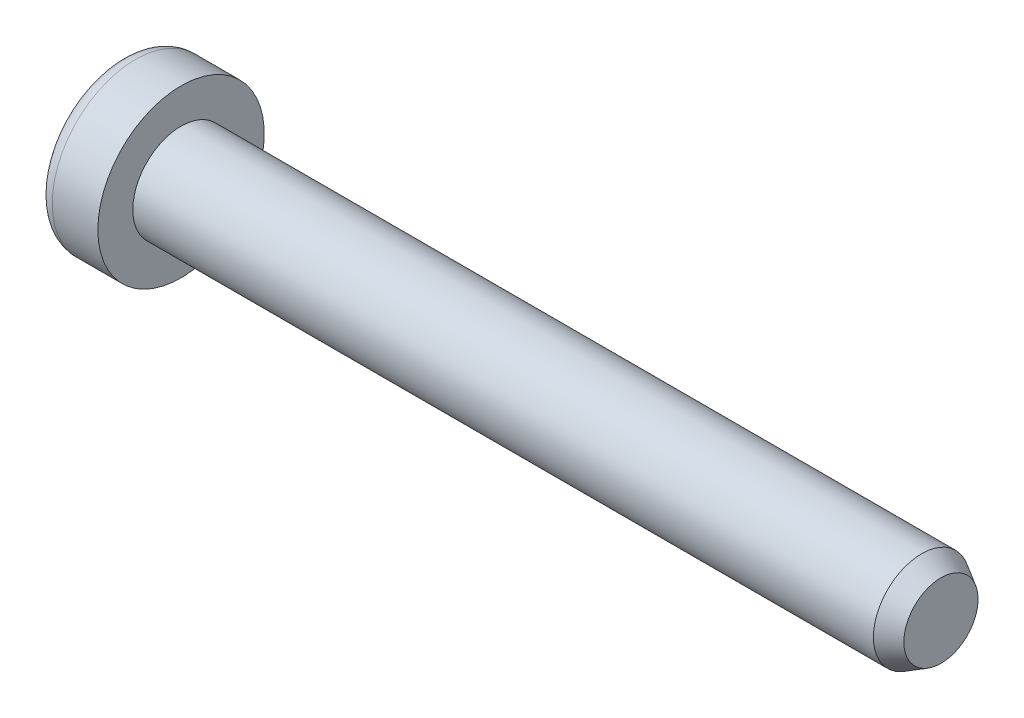
ISO-10303-21;
HEADER;
FILE_DESCRIPTION(('STEP AP214'),'2;1');
FILE_NAME('part.step','',(''),(''),'','','');
FILE_SCHEMA(('AUTOMOTIVE_DESIGN { 1 0 10303 214 1 1 1 1 }'));
ENDSEC;
DATA;
#1=APPLICATION_CONTEXT('core data for automotive mechanical design processes');
#2=APPLICATION_PROTOCOL_DEFINITION('international standard','automotive_design',2000,#1);
#3=PRODUCT_CONTEXT('',#1,'mechanical');
#4=PRODUCT('Part','Part','',(#3));
#5=PRODUCT_RELATED_PRODUCT_CATEGORY('part','',(#4));
#6=PRODUCT_DEFINITION_FORMATION('','',#4);
#7=PRODUCT_DEFINITION_CONTEXT('part definition',#1,'design');
#8=PRODUCT_DEFINITION('design','',#6,#7);
#9=PRODUCT_DEFINITION_SHAPE('','',#8);
#10=(LENGTH_UNIT() NAMED_UNIT(*) SI_UNIT(.MILLI.,.METRE.));
#11=(NAMED_UNIT(*) PLANE_ANGLE_UNIT() SI_UNIT($,.RADIAN.));
#12=(NAMED_UNIT(*) SI_UNIT($,.STERADIAN.) SOLID_ANGLE_UNIT());
#13=UNCERTAINTY_MEASURE_WITH_UNIT(LENGTH_MEASURE(1.E-05),#10,'distance_accuracy_value','');
#14=(GEOMETRIC_REPRESENTATION_CONTEXT(3) GLOBAL_UNCERTAINTY_ASSIGNED_CONTEXT((#13)) GLOBAL_UNIT_ASSIGNED_CONTEXT((#10,
#11,#12)) REPRESENTATION_CONTEXT('',''));
#15=CARTESIAN_POINT('',(0.,0.,0.));
#16=DIRECTION('',(0.,0.,1.));
#17=DIRECTION('',(1.,0.,0.));
#18=AXIS2_PLACEMENT_3D('',#15,#16,#17);
#19=CARTESIAN_POINT('',(-0.2794,0.2413,0.2413));
#20=DIRECTION('',(0.,0.,1.));
#21=DIRECTION('',(1.,0.,0.));
#22=AXIS2_PLACEMENT_3D('',#19,#20,#21);
#23=PLANE('',#22);
#24=DIRECTION('',(1.,0.,0.));
#25=VECTOR('',#24,1.);
#26=CARTESIAN_POINT('',(-0.2794,1.4732,0.2413));
#27=LINE('',#26,#25);
#28=CARTESIAN_POINT('',(-2.03199999873,1.4732,0.2413));
#29=VERTEX_POINT('',#28);
#30=CARTESIAN_POINT('',(-0.2794,1.4732,0.2413));
#31=VERTEX_POINT('',#30);
#32=EDGE_CURVE('E122',#29,#31,#27,.T.);
#33=ORIENTED_EDGE('',*,*,#32,.T.);
#34=DIRECTION('',(0.,1.,0.));
#35=VECTOR('',#34,1.);
#36=CARTESIAN_POINT('',(-0.2794,0.2413,0.2413));
#37=LINE('',#36,#35);
#38=CARTESIAN_POINT('',(-0.2794,0.2413,0.2413));
#39=VERTEX_POINT('',#38);
#40=EDGE_CURVE('E112',#39,#31,#37,.T.);
#41=ORIENTED_EDGE('',*,*,#40,.F.);
#42=DIRECTION('',(1.,0.,0.));
#43=VECTOR('',#42,1.);
#44=CARTESIAN_POINT('',(-0.279400000000001,0.2413,0.2413));
#45=LINE('',#44,#43);
#46=CARTESIAN_POINT('',(-2.03199999873,0.2413,0.2413));
#47=VERTEX_POINT('',#46);
#48=EDGE_CURVE('E381',#39,#47,#45,.F.);
#49=ORIENTED_EDGE('',*,*,#48,.T.);
#50=DIRECTION('',(0.,1.,0.));
#51=VECTOR('',#50,1.);
#52=CARTESIAN_POINT('',(-2.03199999873,0.2413,0.2413));
#53=LINE('',#52,#51);
#54=EDGE_CURVE('E107',#29,#47,#53,.F.);
#55=ORIENTED_EDGE('',*,*,#54,.F.);
#56=EDGE_LOOP('',(#33,#41,#49,#55));
#57=FACE_BOUND('',#56,.T.);
#58=ADVANCED_FACE('F16',(#57),#23,.F.);
#59=CARTESIAN_POINT('',(-0.2794,1.4732,0.2413));
#60=DIRECTION('',(0.,1.,0.));
#61=DIRECTION('',(0.,0.,1.));
#62=AXIS2_PLACEMENT_3D('',#59,#60,#61);
#63=PLANE('',#62);
#64=DIRECTION('',(-1.,0.,0.));
#65=VECTOR('',#64,1.);
#66=CARTESIAN_POINT('',(-0.2794,1.4732,-0.2413));
#67=LINE('',#66,#65);
#68=CARTESIAN_POINT('',(-2.03199999873,1.4732,-0.2413));
#69=VERTEX_POINT('',#68);
#70=CARTESIAN_POINT('',(-0.2794,1.4732,-0.2413));
#71=VERTEX_POINT('',#70);
#72=EDGE_CURVE('E127',#69,#71,#67,.F.);
#73=ORIENTED_EDGE('',*,*,#72,.T.);
#74=DIRECTION('',(0.,0.,1.));
#75=VECTOR('',#74,1.);
#76=CARTESIAN_POINT('',(-0.2794,1.4732,0.2413));
#77=LINE('',#76,#75);
#78=EDGE_CURVE('E115',#31,#71,#77,.F.);
#79=ORIENTED_EDGE('',*,*,#78,.F.);
#80=ORIENTED_EDGE('',*,*,#32,.F.);
#81=DIRECTION('',(0.,0.,1.));
#82=VECTOR('',#81,1.);
#83=CARTESIAN_POINT('',(-2.03199999873,1.4732,0.2413));
#84=LINE('',#83,#82);
#85=EDGE_CURVE('E129',#69,#29,#84,.T.);
#86=ORIENTED_EDGE('',*,*,#85,.F.);
#87=EDGE_LOOP('',(#73,#79,#80,#86));
#88=FACE_BOUND('',#87,.T.);
#89=ADVANCED_FACE('F125',(#88),#63,.F.);
#90=CARTESIAN_POINT('',(-0.279400000000001,0.2413,1.4732));
#91=DIRECTION('',(0.,1.,0.));
#92=DIRECTION('',(0.,0.,1.));
#93=AXIS2_PLACEMENT_3D('',#90,#91,#92);
#94=PLANE('',#93);
#95=ORIENTED_EDGE('',*,*,#48,.F.);
#96=DIRECTION('',(0.,0.,1.));
#97=VECTOR('',#96,1.);
#98=CARTESIAN_POINT('',(-0.279400000000001,0.2413,1.4732));
#99=LINE('',#98,#97);
#100=CARTESIAN_POINT('',(-0.279400000000001,0.2413,1.4732));
#101=VERTEX_POINT('',#100);
#102=EDGE_CURVE('E118',#101,#39,#99,.F.);
#103=ORIENTED_EDGE('',*,*,#102,.F.);
#104=DIRECTION('',(1.,0.,0.));
#105=VECTOR('',#104,1.);
#106=CARTESIAN_POINT('',(-0.279400000000001,0.2413,1.4732));
#107=LINE('',#106,#105);
#108=CARTESIAN_POINT('',(-2.03199999873,0.2413,1.4732));
#109=VERTEX_POINT('',#108);
#110=EDGE_CURVE('E396',#101,#109,#107,.F.);
#111=ORIENTED_EDGE('',*,*,#110,.T.);
#112=DIRECTION('',(0.,0.,1.));
#113=VECTOR('',#112,1.);
#114=CARTESIAN_POINT('',(-2.03199999873,0.2413,1.4732));
#115=LINE('',#114,#113);
#116=EDGE_CURVE('E384',#47,#109,#115,.T.);
#117=ORIENTED_EDGE('',*,*,#116,.F.);
#118=EDGE_LOOP('',(#95,#103,#111,#117));
#119=FACE_BOUND('',#118,.T.);
#120=ADVANCED_FACE('F207',(#119),#94,.F.);
#121=CARTESIAN_POINT('',(-0.2794,1.4732,-0.2413));
#122=DIRECTION('',(0.,0.,-1.));
#123=DIRECTION('',(-1.,0.,0.));
#124=AXIS2_PLACEMENT_3D('',#121,#122,#123);
#125=PLANE('',#124);
#126=DIRECTION('',(1.,0.,0.));
#127=VECTOR('',#126,1.);
#128=CARTESIAN_POINT('',(-0.2794,0.2413,-0.2413));
#129=LINE('',#128,#127);
#130=CARTESIAN_POINT('',(-2.03199999873,0.2413,-0.2413));
#131=VERTEX_POINT('',#130);
#132=CARTESIAN_POINT('',(-0.2794,0.2413,-0.2413));
#133=VERTEX_POINT('',#132);
#134=EDGE_CURVE('E400',#131,#133,#129,.T.);
#135=ORIENTED_EDGE('',*,*,#134,.T.);
#136=DIRECTION('',(0.,1.,0.));
#137=VECTOR('',#136,1.);
#138=CARTESIAN_POINT('',(-0.2794,1.4732,-0.2413));
#139=LINE('',#138,#137);
#140=EDGE_CURVE('E389',#71,#133,#139,.F.);
#141=ORIENTED_EDGE('',*,*,#140,.F.);
#142=ORIENTED_EDGE('',*,*,#72,.F.);
#143=DIRECTION('',(0.,1.,0.));
#144=VECTOR('',#143,1.);
#145=CARTESIAN_POINT('',(-2.03199999873,1.4732,-0.2413));
#146=LINE('',#145,#144);
#147=EDGE_CURVE('E391',#131,#69,#146,.T.);
#148=ORIENTED_EDGE('',*,*,#147,.F.);
#149=EDGE_LOOP('',(#135,#141,#142,#148));
#150=FACE_BOUND('',#149,.T.);
#151=ADVANCED_FACE('F203',(#150),#125,.F.);
#152=CARTESIAN_POINT('',(-0.279400000000001,-0.2413,1.4732));
#153=DIRECTION('',(0.,0.,1.));
#154=DIRECTION('',(1.,0.,0.));
#155=AXIS2_PLACEMENT_3D('',#152,#153,#154);
#156=PLANE('',#155);
#157=ORIENTED_EDGE('',*,*,#110,.F.);
#158=DIRECTION('',(0.,1.,0.));
#159=VECTOR('',#158,1.);
#160=CARTESIAN_POINT('',(-0.279400000000001,-0.2413,1.4732));
#161=LINE('',#160,#159);
#162=CARTESIAN_POINT('',(-0.279400000000001,-0.2413,1.4732));
#163=VERTEX_POINT('',#162);
#164=EDGE_CURVE('E394',#163,#101,#161,.T.);
#165=ORIENTED_EDGE('',*,*,#164,.F.);
#166=DIRECTION('',(1.,0.,0.));
#167=VECTOR('',#166,1.);
#168=CARTESIAN_POINT('',(-0.2794,-0.2413,1.4732));
#169=LINE('',#168,#167);
#170=CARTESIAN_POINT('',(-2.03199999873,-0.2413,1.4732));
#171=VERTEX_POINT('',#170);
#172=EDGE_CURVE('E410',#163,#171,#169,.F.);
#173=ORIENTED_EDGE('',*,*,#172,.T.);
#174=DIRECTION('',(0.,1.,0.));
#175=VECTOR('',#174,1.);
#176=CARTESIAN_POINT('',(-2.03199999873,-0.2413,1.4732));
#177=LINE('',#176,#175);
#178=EDGE_CURVE('E398',#109,#171,#177,.F.);
#179=ORIENTED_EDGE('',*,*,#178,.F.);
#180=EDGE_LOOP('',(#157,#165,#173,#179));
#181=FACE_BOUND('',#180,.T.);
#182=ADVANCED_FACE('F199',(#181),#156,.F.);
#183=CARTESIAN_POINT('',(-0.2794,0.2413,-0.2413));
#184=DIRECTION('',(0.,1.,0.));
#185=DIRECTION('',(0.,0.,1.));
#186=AXIS2_PLACEMENT_3D('',#183,#184,#185);
#187=PLANE('',#186);
#188=DIRECTION('',(-1.,0.,0.));
#189=VECTOR('',#188,1.);
#190=CARTESIAN_POINT('',(-0.2794,0.2413,-1.4732));
#191=LINE('',#190,#189);
#192=CARTESIAN_POINT('',(-2.03199999873,0.2413,-1.4732));
#193=VERTEX_POINT('',#192);
#194=CARTESIAN_POINT('',(-0.2794,0.2413,-1.4732));
#195=VERTEX_POINT('',#194);
#196=EDGE_CURVE('E415',#193,#195,#191,.F.);
#197=ORIENTED_EDGE('',*,*,#196,.T.);
#198=DIRECTION('',(0.,0.,1.));
#199=VECTOR('',#198,1.);
#200=CARTESIAN_POINT('',(-0.2794,0.2413,-0.2413));
#201=LINE('',#200,#199);
#202=EDGE_CURVE('E403',#133,#195,#201,.F.);
#203=ORIENTED_EDGE('',*,*,#202,.F.);
#204=ORIENTED_EDGE('',*,*,#134,.F.);
#205=DIRECTION('',(0.,0.,1.));
#206=VECTOR('',#205,1.);
#207=CARTESIAN_POINT('',(-2.03199999873,0.2413,-0.2413));
#208=LINE('',#207,#206);
#209=EDGE_CURVE('E405',#193,#131,#208,.T.);
#210=ORIENTED_EDGE('',*,*,#209,.F.);
#211=EDGE_LOOP('',(#197,#203,#204,#210));
#212=FACE_BOUND('',#211,.T.);
#213=ADVANCED_FACE('F195',(#212),#187,.F.);
#214=CARTESIAN_POINT('',(-0.2794,-0.2413,0.2413));
#215=DIRECTION('',(0.,-1.,0.));
#216=DIRECTION('',(0.,0.,-1.));
#217=AXIS2_PLACEMENT_3D('',#214,#215,#216);
#218=PLANE('',#217);
#219=ORIENTED_EDGE('',*,*,#172,.F.);
#220=DIRECTION('',(0.,0.,-1.));
#221=VECTOR('',#220,1.);
#222=CARTESIAN_POINT('',(-0.2794,-0.2413,0.2413));
#223=LINE('',#222,#221);
#224=CARTESIAN_POINT('',(-0.2794,-0.2413,0.2413));
#225=VERTEX_POINT('',#224);
#226=EDGE_CURVE('E408',#225,#163,#223,.F.);
#227=ORIENTED_EDGE('',*,*,#226,.F.);
#228=DIRECTION('',(1.,0.,0.));
#229=VECTOR('',#228,1.);
#230=CARTESIAN_POINT('',(-0.2794,-0.2413,0.2413));
#231=LINE('',#230,#229);
#232=CARTESIAN_POINT('',(-2.03199999873,-0.2413,0.2413));
#233=VERTEX_POINT('',#232);
#234=EDGE_CURVE('E423',#225,#233,#231,.F.);
#235=ORIENTED_EDGE('',*,*,#234,.T.);
#236=DIRECTION('',(0.,0.,-1.));
#237=VECTOR('',#236,1.);
#238=CARTESIAN_POINT('',(-2.03199999873,-0.2413,0.2413));
#239=LINE('',#238,#237);
#240=EDGE_CURVE('E413',#171,#233,#239,.T.);
#241=ORIENTED_EDGE('',*,*,#240,.F.);
#242=EDGE_LOOP('',(#219,#227,#235,#241));
#243=FACE_BOUND('',#242,.T.);
#244=ADVANCED_FACE('F191',(#243),#218,.F.);
#245=CARTESIAN_POINT('',(-0.2794,0.2413,-1.4732));
#246=DIRECTION('',(0.,0.,-1.));
#247=DIRECTION('',(-1.,0.,0.));
#248=AXIS2_PLACEMENT_3D('',#245,#246,#247);
#249=PLANE('',#248);
#250=DIRECTION('',(1.,0.,0.));
#251=VECTOR('',#250,1.);
#252=CARTESIAN_POINT('',(-0.2794,-0.2413,-1.4732));
#253=LINE('',#252,#251);
#254=CARTESIAN_POINT('',(-2.03199999873,-0.2413,-1.4732));
#255=VERTEX_POINT('',#254);
#256=CARTESIAN_POINT('',(-0.2794,-0.2413,-1.4732));
#257=VERTEX_POINT('',#256);
#258=EDGE_CURVE('E428',#255,#257,#253,.T.);
#259=ORIENTED_EDGE('',*,*,#258,.T.);
#260=DIRECTION('',(0.,1.,0.));
#261=VECTOR('',#260,1.);
#262=CARTESIAN_POINT('',(-0.2794,0.2413,-1.4732));
#263=LINE('',#262,#261);
#264=EDGE_CURVE('E418',#195,#257,#263,.F.);
#265=ORIENTED_EDGE('',*,*,#264,.F.);
#266=ORIENTED_EDGE('',*,*,#196,.F.);
#267=DIRECTION('',(0.,1.,0.));
#268=VECTOR('',#267,1.);
#269=CARTESIAN_POINT('',(-2.03199999873,0.2413,-1.4732));
#270=LINE('',#269,#268);
#271=EDGE_CURVE('E420',#255,#193,#270,.T.);
#272=ORIENTED_EDGE('',*,*,#271,.F.);
#273=EDGE_LOOP('',(#259,#265,#266,#272));
#274=FACE_BOUND('',#273,.T.);
#275=ADVANCED_FACE('F187',(#274),#249,.F.);
#276=CARTESIAN_POINT('',(-0.2794,-1.4732,0.2413));
#277=DIRECTION('',(0.,0.,1.));
#278=DIRECTION('',(1.,0.,0.));
#279=AXIS2_PLACEMENT_3D('',#276,#277,#278);
#280=PLANE('',#279);
#281=ORIENTED_EDGE('',*,*,#234,.F.);
#282=DIRECTION('',(0.,1.,0.));
#283=VECTOR('',#282,1.);
#284=CARTESIAN_POINT('',(-0.2794,-0.2413,0.2413));
#285=LINE('',#284,#283);
#286=CARTESIAN_POINT('',(-0.2794,-1.4732,0.2413));
#287=VERTEX_POINT('',#286);
#288=EDGE_CURVE('E434',#225,#287,#285,.F.);
#289=ORIENTED_EDGE('',*,*,#288,.T.);
#290=DIRECTION('',(1.,0.,0.));
#291=VECTOR('',#290,1.);
#292=CARTESIAN_POINT('',(-0.2794,-1.4732,0.2413));
#293=LINE('',#292,#291);
#294=CARTESIAN_POINT('',(-2.03199999873,-1.4732,0.2413));
#295=VERTEX_POINT('',#294);
#296=EDGE_CURVE('E442',#287,#295,#293,.F.);
#297=ORIENTED_EDGE('',*,*,#296,.T.);
#298=DIRECTION('',(0.,1.,0.));
#299=VECTOR('',#298,1.);
#300=CARTESIAN_POINT('',(-2.03199999873,-1.4732,0.2413));
#301=LINE('',#300,#299);
#302=EDGE_CURVE('E426',#233,#295,#301,.F.);
#303=ORIENTED_EDGE('',*,*,#302,.F.);
#304=EDGE_LOOP('',(#281,#289,#297,#303));
#305=FACE_BOUND('',#304,.T.);
#306=ADVANCED_FACE('F183',(#305),#280,.F.);
#307=CARTESIAN_POINT('',(-0.2794,-0.2413,-1.4732));
#308=DIRECTION('',(0.,-1.,0.));
#309=DIRECTION('',(0.,0.,-1.));
#310=AXIS2_PLACEMENT_3D('',#307,#308,#309);
#311=PLANE('',#310);
#312=DIRECTION('',(-1.,0.,0.));
#313=VECTOR('',#312,1.);
#314=CARTESIAN_POINT('',(-0.2794,-0.2413,-0.2413));
#315=LINE('',#314,#313);
#316=CARTESIAN_POINT('',(-2.03199999873,-0.2413,-0.2413));
#317=VERTEX_POINT('',#316);
#318=CARTESIAN_POINT('',(-0.2794,-0.2413,-0.2413));
#319=VERTEX_POINT('',#318);
#320=EDGE_CURVE('E448',#317,#319,#315,.F.);
#321=ORIENTED_EDGE('',*,*,#320,.T.);
#322=DIRECTION('',(0.,0.,-1.));
#323=VECTOR('',#322,1.);
#324=CARTESIAN_POINT('',(-0.2794,-0.2413,-0.2413));
#325=LINE('',#324,#323);
#326=EDGE_CURVE('E436',#319,#257,#325,.T.);
#327=ORIENTED_EDGE('',*,*,#326,.T.);
#328=ORIENTED_EDGE('',*,*,#258,.F.);
#329=DIRECTION('',(0.,0.,-1.));
#330=VECTOR('',#329,1.);
#331=CARTESIAN_POINT('',(-2.03199999873,-0.2413,-1.4732));
#332=LINE('',#331,#330);
#333=EDGE_CURVE('E431',#317,#255,#332,.T.);
#334=ORIENTED_EDGE('',*,*,#333,.F.);
#335=EDGE_LOOP('',(#321,#327,#328,#334));
#336=FACE_BOUND('',#335,.T.);
#337=ADVANCED_FACE('F180',(#336),#311,.F.);
#338=CARTESIAN_POINT('',(-0.2794,-0.2413,-0.2413));
#339=DIRECTION('',(1.,0.,0.));
#340=DIRECTION('',(0.,0.,-1.));
#341=AXIS2_PLACEMENT_3D('',#338,#339,#340);
#342=PLANE('',#341);
#343=DIRECTION('',(0.,1.,0.));
#344=VECTOR('',#343,1.);
#345=CARTESIAN_POINT('',(-0.2794,-0.2413,-0.2413));
#346=LINE('',#345,#344);
#347=CARTESIAN_POINT('',(-0.2794,-1.4732,-0.2413));
#348=VERTEX_POINT('',#347);
#349=EDGE_CURVE('E450',#319,#348,#346,.F.);
#350=ORIENTED_EDGE('',*,*,#349,.T.);
#351=DIRECTION('',(0.,0.,-1.));
#352=VECTOR('',#351,1.);
#353=CARTESIAN_POINT('',(-0.2794,-1.4732,-0.2413));
#354=LINE('',#353,#352);
#355=EDGE_CURVE('E439',#348,#287,#354,.F.);
#356=ORIENTED_EDGE('',*,*,#355,.T.);
#357=ORIENTED_EDGE('',*,*,#288,.F.);
#358=ORIENTED_EDGE('',*,*,#226,.T.);
#359=ORIENTED_EDGE('',*,*,#164,.T.);
#360=ORIENTED_EDGE('',*,*,#102,.T.);
#361=ORIENTED_EDGE('',*,*,#40,.T.);
#362=ORIENTED_EDGE('',*,*,#78,.T.);
#363=ORIENTED_EDGE('',*,*,#140,.T.);
#364=ORIENTED_EDGE('',*,*,#202,.T.);
#365=ORIENTED_EDGE('',*,*,#264,.T.);
#366=ORIENTED_EDGE('',*,*,#326,.F.);
#367=EDGE_LOOP('',(#350,#356,#357,#358,#359,#360,#361,#362,#363,#364,#365,#366));
#368=FACE_BOUND('',#367,.T.);
#369=ADVANCED_FACE('F113',(#368),#342,.F.);
#370=CARTESIAN_POINT('',(-0.2794,-1.4732,-0.2413));
#371=DIRECTION('',(0.,-1.,0.));
#372=DIRECTION('',(0.,0.,-1.));
#373=AXIS2_PLACEMENT_3D('',#370,#371,#372);
#374=PLANE('',#373);
#375=ORIENTED_EDGE('',*,*,#296,.F.);
#376=ORIENTED_EDGE('',*,*,#355,.F.);
#377=DIRECTION('',(-1.,0.,0.));
#378=VECTOR('',#377,1.);
#379=CARTESIAN_POINT('',(-0.2794,-1.4732,-0.2413));
#380=LINE('',#379,#378);
#381=CARTESIAN_POINT('',(-2.03199999873,-1.4732,-0.2413));
#382=VERTEX_POINT('',#381);
#383=EDGE_CURVE('E452',#348,#382,#380,.T.);
#384=ORIENTED_EDGE('',*,*,#383,.T.);
#385=DIRECTION('',(0.,0.,-1.));
#386=VECTOR('',#385,1.);
#387=CARTESIAN_POINT('',(-2.03199999873,-1.4732,-0.2413));
#388=LINE('',#387,#386);
#389=EDGE_CURVE('E445',#295,#382,#388,.T.);
#390=ORIENTED_EDGE('',*,*,#389,.F.);
#391=EDGE_LOOP('',(#375,#376,#384,#390));
#392=FACE_BOUND('',#391,.T.);
#393=ADVANCED_FACE('F173',(#392),#374,.F.);
#394=CARTESIAN_POINT('',(-0.2794,-0.2413,-0.2413));
#395=DIRECTION('',(0.,0.,-1.));
#396=DIRECTION('',(-1.,0.,0.));
#397=AXIS2_PLACEMENT_3D('',#394,#395,#396);
#398=PLANE('',#397);
#399=ORIENTED_EDGE('',*,*,#383,.F.);
#400=ORIENTED_EDGE('',*,*,#349,.F.);
#401=ORIENTED_EDGE('',*,*,#320,.F.);
#402=DIRECTION('',(0.,1.,0.));
#403=VECTOR('',#402,1.);
#404=CARTESIAN_POINT('',(-2.03199999873,0.,-0.2413));
#405=LINE('',#404,#403);
#406=EDGE_CURVE('E146',#317,#382,#405,.F.);
#407=ORIENTED_EDGE('',*,*,#406,.T.);
#408=EDGE_LOOP('',(#399,#400,#401,#407));
#409=FACE_BOUND('',#408,.T.);
#410=ADVANCED_FACE('F165',(#409),#398,.F.);
#411=CARTESIAN_POINT('',(-2.03199999873,0.,0.));
#412=DIRECTION('',(1.,0.,0.));
#413=DIRECTION('',(0.,0.,-1.));
#414=AXIS2_PLACEMENT_3D('',#411,#412,#413);
#415=PLANE('',#414);
#416=ORIENTED_EDGE('',*,*,#333,.T.);
#417=ORIENTED_EDGE('',*,*,#271,.T.);
#418=ORIENTED_EDGE('',*,*,#209,.T.);
#419=ORIENTED_EDGE('',*,*,#147,.T.);
#420=ORIENTED_EDGE('',*,*,#85,.T.);
#421=ORIENTED_EDGE('',*,*,#54,.T.);
#422=ORIENTED_EDGE('',*,*,#116,.T.);
#423=ORIENTED_EDGE('',*,*,#178,.T.);
#424=ORIENTED_EDGE('',*,*,#240,.T.);
#425=ORIENTED_EDGE('',*,*,#302,.T.);
#426=ORIENTED_EDGE('',*,*,#389,.T.);
#427=ORIENTED_EDGE('',*,*,#406,.F.);
#428=EDGE_LOOP('',(#416,#417,#418,#419,#420,#421,#422,#423,#424,#425,#426,#427));
#429=FACE_BOUND('',#428,.T.);
#430=CARTESIAN_POINT('',(-2.03199999873,0.,0.));
#431=DIRECTION('',(1.,0.,0.));
#432=DIRECTION('',(0.,0.,-1.));
#433=AXIS2_PLACEMENT_3D('',#430,#431,#432);
#434=CIRCLE('',#433,2.2733);
#435=CARTESIAN_POINT('',(-2.03199999873,0.,-2.2733));
#436=VERTEX_POINT('',#435);
#437=CARTESIAN_POINT('',(-2.03199999873,0.,2.2733));
#438=VERTEX_POINT('',#437);
#439=EDGE_CURVE('E35',#436,#438,#434,.T.);
#440=ORIENTED_EDGE('',*,*,#439,.F.);
#441=CARTESIAN_POINT('',(-2.03199999873,0.,0.));
#442=DIRECTION('',(1.,0.,0.));
#443=DIRECTION('',(0.,0.,1.));
#444=AXIS2_PLACEMENT_3D('',#441,#442,#443);
#445=CIRCLE('',#444,2.2733);
#446=EDGE_CURVE('E144',#438,#436,#445,.T.);
#447=ORIENTED_EDGE('',*,*,#446,.F.);
#448=EDGE_LOOP('',(#440,#447));
#449=FACE_BOUND('',#448,.T.);
#450=ADVANCED_FACE('F148',(#429,#449),#415,.F.);
#451=CARTESIAN_POINT('',(-1.52399999873,0.,0.));
#452=DIRECTION('',(1.,0.,0.));
#453=DIRECTION('',(0.,0.,-1.));
#454=AXIS2_PLACEMENT_3D('',#451,#452,#453);
#455=TOROIDAL_SURFACE('',#454,2.2733,0.508);
#456=ORIENTED_EDGE('',*,*,#439,.T.);
#457=ORIENTED_EDGE('',*,*,#446,.T.);
#458=EDGE_LOOP('',(#456,#457));
#459=FACE_BOUND('',#458,.T.);
#460=CARTESIAN_POINT('',(-1.52399999873,0.,0.));
#461=DIRECTION('',(-1.,0.,0.));
#462=DIRECTION('',(0.,0.,1.));
#463=AXIS2_PLACEMENT_3D('',#460,#461,#462);
#464=CIRCLE('',#463,2.7813);
#465=CARTESIAN_POINT('',(-1.52399999873,0.,2.7813));
#466=VERTEX_POINT('',#465);
#467=EDGE_CURVE('E140',#466,#466,#464,.F.);
#468=ORIENTED_EDGE('',*,*,#467,.F.);
#469=EDGE_LOOP('',(#468));
#470=FACE_BOUND('',#469,.T.);
#471=ADVANCED_FACE('F142',(#459,#470),#455,.T.);
#472=CARTESIAN_POINT('',(25.4,0.,0.));
#473=DIRECTION('',(1.,0.,0.));
#474=DIRECTION('',(0.,0.,-1.));
#475=AXIS2_PLACEMENT_3D('',#472,#473,#474);
#476=PLANE('',#475);
#477=CARTESIAN_POINT('',(25.3999999999905,0.,0.));
#478=DIRECTION('',(-1.,0.,0.));
#479=DIRECTION('',(0.,0.,1.));
#480=AXIS2_PLACEMENT_3D('',#477,#478,#479);
#481=CIRCLE('',#480,1.24041670041546);
#482=CARTESIAN_POINT('',(25.3999999999905,0.,1.24041670041546));
#483=VERTEX_POINT('',#482);
#484=EDGE_CURVE('E138',#483,#483,#481,.T.);
#485=ORIENTED_EDGE('',*,*,#484,.F.);
#486=EDGE_LOOP('',(#485));
#487=FACE_BOUND('',#486,.T.);
#488=ADVANCED_FACE('F235',(#487),#476,.T.);
#489=CARTESIAN_POINT('',(0.,0.,0.));
#490=DIRECTION('',(-1.,0.,0.));
#491=DIRECTION('',(0.,0.,1.));
#492=AXIS2_PLACEMENT_3D('',#489,#490,#491);
#493=CYLINDRICAL_SURFACE('',#492,2.7813);
#494=CARTESIAN_POINT('',(0.,0.,0.));
#495=DIRECTION('',(-1.,0.,0.));
#496=DIRECTION('',(0.,0.,1.));
#497=AXIS2_PLACEMENT_3D('',#494,#495,#496);
#498=CIRCLE('',#497,2.7813);
#499=CARTESIAN_POINT('',(0.,0.,2.7813));
#500=VERTEX_POINT('',#499);
#501=EDGE_CURVE('E135',#500,#500,#498,.F.);
#502=ORIENTED_EDGE('',*,*,#501,.F.);
#503=EDGE_LOOP('',(#502));
#504=FACE_BOUND('',#503,.T.);
#505=ORIENTED_EDGE('',*,*,#467,.T.);
#506=EDGE_LOOP('',(#505));
#507=FACE_BOUND('',#506,.T.);
#508=ADVANCED_FACE('F232',(#504,#507),#493,.T.);
#509=CARTESIAN_POINT('',(24.7548400002415,0.,0.));
#510=DIRECTION('',(-1.,0.,0.));
#511=DIRECTION('',(0.,0.,1.));
#512=AXIS2_PLACEMENT_3D('',#509,#510,#511);
#513=CONICAL_SURFACE('',#512,1.61289999994097,0.523598775598337);
#514=ORIENTED_EDGE('',*,*,#484,.T.);
#515=EDGE_LOOP('',(#514));
#516=FACE_BOUND('',#515,.T.);
#517=CARTESIAN_POINT('',(24.75484,0.,0.));
#518=DIRECTION('',(-1.,0.,0.));
#519=DIRECTION('',(0.,0.,1.));
#520=AXIS2_PLACEMENT_3D('',#517,#518,#519);
#521=CIRCLE('',#520,1.6129);
#522=CARTESIAN_POINT('',(24.75484,0.,1.61290000000001));
#523=VERTEX_POINT('',#522);
#524=EDGE_CURVE('E27',#523,#523,#521,.T.);
#525=ORIENTED_EDGE('',*,*,#524,.F.);
#526=EDGE_LOOP('',(#525));
#527=FACE_BOUND('',#526,.T.);
#528=ADVANCED_FACE('F225',(#516,#527),#513,.T.);
#529=CARTESIAN_POINT('',(0.,0.,0.));
#530=DIRECTION('',(1.,0.,0.));
#531=DIRECTION('',(0.,0.,-1.));
#532=AXIS2_PLACEMENT_3D('',#529,#530,#531);
#533=PLANE('',#532);
#534=CARTESIAN_POINT('',(0.,0.,0.));
#535=DIRECTION('',(-1.,0.,0.));
#536=DIRECTION('',(0.,0.,1.));
#537=AXIS2_PLACEMENT_3D('',#534,#535,#536);
#538=CIRCLE('',#537,1.6129);
#539=CARTESIAN_POINT('',(0.,0.,1.6129));
#540=VERTEX_POINT('',#539);
#541=EDGE_CURVE('E11',#540,#540,#538,.F.);
#542=ORIENTED_EDGE('',*,*,#541,.F.);
#543=EDGE_LOOP('',(#542));
#544=FACE_BOUND('',#543,.T.);
#545=ORIENTED_EDGE('',*,*,#501,.T.);
#546=EDGE_LOOP('',(#545));
#547=FACE_BOUND('',#546,.T.);
#548=ADVANCED_FACE('F219',(#544,#547),#533,.T.);
#549=CARTESIAN_POINT('',(24.75484,0.,0.));
#550=DIRECTION('',(-1.,0.,0.));
#551=DIRECTION('',(0.,0.,1.));
#552=AXIS2_PLACEMENT_3D('',#549,#550,#551);
#553=CYLINDRICAL_SURFACE('',#552,1.6129);
#554=ORIENTED_EDGE('',*,*,#541,.T.);
#555=EDGE_LOOP('',(#554));
#556=FACE_BOUND('',#555,.T.);
#557=ORIENTED_EDGE('',*,*,#524,.T.);
#558=EDGE_LOOP('',(#557));
#559=FACE_BOUND('',#558,.T.);
#560=ADVANCED_FACE('F217',(#556,#559),#553,.T.);
#561=CLOSED_SHELL('',(#58,#89,#120,#151,#182,#213,#244,#275,#306,#337,#369,#393,#410,#450,#471,
#488,#508,#528,#548,#560));
#562=MANIFOLD_SOLID_BREP('B1',#561);
#563=ADVANCED_BREP_SHAPE_REPRESENTATION('',(#18,#562),#14);
#564=SHAPE_DEFINITION_REPRESENTATION(#9,#563);
ENDSEC;
END-ISO-10303-21;
